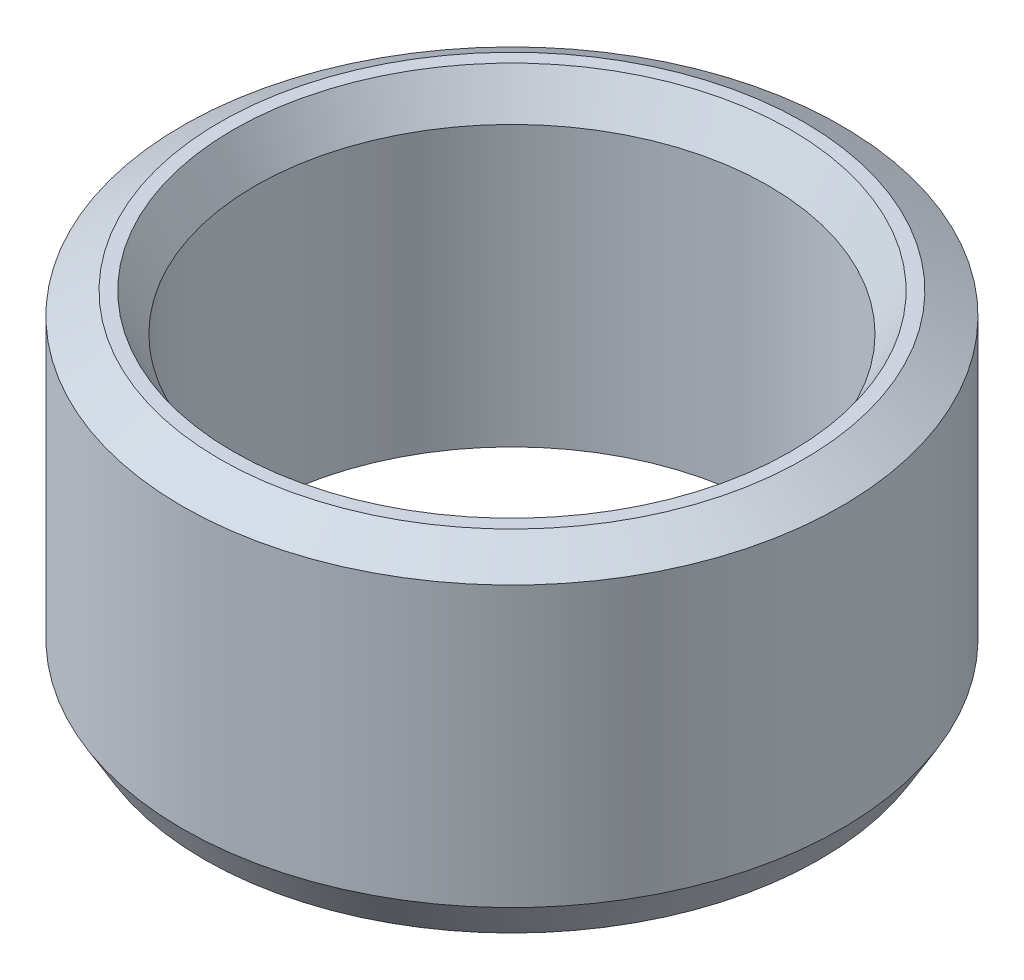
ISO-10303-21;
HEADER;
FILE_DESCRIPTION(('STEP AP214'),'2;1');
FILE_NAME('part.step','',(''),(''),'','','');
FILE_SCHEMA(('AUTOMOTIVE_DESIGN { 1 0 10303 214 1 1 1 1 }'));
ENDSEC;
DATA;
#1=APPLICATION_CONTEXT('core data for automotive mechanical design processes');
#2=APPLICATION_PROTOCOL_DEFINITION('international standard','automotive_design',2000,#1);
#3=PRODUCT_CONTEXT('',#1,'mechanical');
#4=PRODUCT('Part','Part','',(#3));
#5=PRODUCT_RELATED_PRODUCT_CATEGORY('part','',(#4));
#6=PRODUCT_DEFINITION_FORMATION('','',#4);
#7=PRODUCT_DEFINITION_CONTEXT('part definition',#1,'design');
#8=PRODUCT_DEFINITION('design','',#6,#7);
#9=PRODUCT_DEFINITION_SHAPE('','',#8);
#10=(LENGTH_UNIT() NAMED_UNIT(*) SI_UNIT(.MILLI.,.METRE.));
#11=(NAMED_UNIT(*) PLANE_ANGLE_UNIT() SI_UNIT($,.RADIAN.));
#12=(NAMED_UNIT(*) SI_UNIT($,.STERADIAN.) SOLID_ANGLE_UNIT());
#13=UNCERTAINTY_MEASURE_WITH_UNIT(LENGTH_MEASURE(1.E-05),#10,'distance_accuracy_value','');
#14=(GEOMETRIC_REPRESENTATION_CONTEXT(3) GLOBAL_UNCERTAINTY_ASSIGNED_CONTEXT((#13)) GLOBAL_UNIT_ASSIGNED_CONTEXT((#10,
#11,#12)) REPRESENTATION_CONTEXT('',''));
#15=CARTESIAN_POINT('',(0.,0.,0.));
#16=DIRECTION('',(0.,0.,1.));
#17=DIRECTION('',(1.,0.,0.));
#18=AXIS2_PLACEMENT_3D('',#15,#16,#17);
#19=CARTESIAN_POINT('',(0.,56.5471344407308,0.));
#20=DIRECTION('',(0.,-1.,0.));
#21=DIRECTION('',(0.,0.,-1.));
#22=AXIS2_PLACEMENT_3D('',#19,#20,#21);
#23=CYLINDRICAL_SURFACE('',#22,55.);
#24=CARTESIAN_POINT('',(0.,6.27071372216204,0.));
#25=DIRECTION('',(0.,1.,0.));
#26=DIRECTION('',(0.,0.,1.));
#27=AXIS2_PLACEMENT_3D('',#24,#25,#26);
#28=CIRCLE('',#27,55.);
#29=CARTESIAN_POINT('',(0.,6.27071372216204,55.));
#30=VERTEX_POINT('',#29);
#31=EDGE_CURVE('E10',#30,#30,#28,.T.);
#32=ORIENTED_EDGE('',*,*,#31,.T.);
#33=EDGE_LOOP('',(#32));
#34=FACE_BOUND('',#33,.T.);
#35=CARTESIAN_POINT('',(0.,52.8802172295628,0.));
#36=DIRECTION('',(0.,1.,0.));
#37=DIRECTION('',(0.,0.,1.));
#38=AXIS2_PLACEMENT_3D('',#35,#36,#37);
#39=CIRCLE('',#38,55.);
#40=CARTESIAN_POINT('',(0.,52.8802172295628,55.));
#41=VERTEX_POINT('',#40);
#42=EDGE_CURVE('E50',#41,#41,#39,.F.);
#43=ORIENTED_EDGE('',*,*,#42,.T.);
#44=EDGE_LOOP('',(#43));
#45=FACE_BOUND('',#44,.T.);
#46=ADVANCED_FACE('F39',(#34,#45),#23,.T.);
#47=CARTESIAN_POINT('',(0.,56.5471344407308,0.));
#48=DIRECTION('',(0.,1.,0.));
#49=DIRECTION('',(0.,0.,1.));
#50=AXIS2_PLACEMENT_3D('',#47,#48,#49);
#51=PLANE('',#50);
#52=CARTESIAN_POINT('',(0.,56.5471344407308,0.));
#53=DIRECTION('',(0.,1.,0.));
#54=DIRECTION('',(0.,0.,1.));
#55=AXIS2_PLACEMENT_3D('',#52,#53,#54);
#56=CIRCLE('',#55,46.516182477283);
#57=CARTESIAN_POINT('',(0.,56.5471344407308,46.516182477283));
#58=VERTEX_POINT('',#57);
#59=EDGE_CURVE('E58',#58,#58,#56,.F.);
#60=ORIENTED_EDGE('',*,*,#59,.T.);
#61=EDGE_LOOP('',(#60));
#62=FACE_BOUND('',#61,.T.);
#63=CARTESIAN_POINT('',(0.,56.5471344407308,0.));
#64=DIRECTION('',(0.,1.,0.));
#65=DIRECTION('',(0.,0.,1.));
#66=AXIS2_PLACEMENT_3D('',#63,#64,#65);
#67=CIRCLE('',#66,48.7292862778379);
#68=CARTESIAN_POINT('',(0.,56.5471344407308,48.7292862778379));
#69=VERTEX_POINT('',#68);
#70=EDGE_CURVE('E61',#69,#69,#67,.T.);
#71=ORIENTED_EDGE('',*,*,#70,.T.);
#72=EDGE_LOOP('',(#71));
#73=FACE_BOUND('',#72,.T.);
#74=ADVANCED_FACE('F88',(#62,#73),#51,.T.);
#75=CARTESIAN_POINT('',(0.,0.,0.));
#76=DIRECTION('',(0.,1.,0.));
#77=DIRECTION('',(0.,0.,1.));
#78=AXIS2_PLACEMENT_3D('',#75,#76,#77);
#79=PLANE('',#78);
#80=CARTESIAN_POINT('',(0.,0.,0.));
#81=DIRECTION('',(0.,1.,0.));
#82=DIRECTION('',(0.,0.,1.));
#83=AXIS2_PLACEMENT_3D('',#80,#81,#82);
#84=CIRCLE('',#83,49.1199789882771);
#85=CARTESIAN_POINT('',(0.,0.,49.1199789882771));
#86=VERTEX_POINT('',#85);
#87=EDGE_CURVE('E51',#86,#86,#84,.T.);
#88=ORIENTED_EDGE('',*,*,#87,.T.);
#89=EDGE_LOOP('',(#88));
#90=FACE_BOUND('',#89,.T.);
#91=CARTESIAN_POINT('',(0.,0.,0.));
#92=DIRECTION('',(0.,1.,0.));
#93=DIRECTION('',(0.,0.,1.));
#94=AXIS2_PLACEMENT_3D('',#91,#92,#93);
#95=CIRCLE('',#94,51.3330827888321);
#96=CARTESIAN_POINT('',(0.,0.,51.3330827888321));
#97=VERTEX_POINT('',#96);
#98=EDGE_CURVE('E54',#97,#97,#95,.F.);
#99=ORIENTED_EDGE('',*,*,#98,.T.);
#100=EDGE_LOOP('',(#99));
#101=FACE_BOUND('',#100,.T.);
#102=ADVANCED_FACE('F83',(#90,#101),#79,.F.);
#103=CARTESIAN_POINT('',(0.,56.5471344407308,0.));
#104=DIRECTION('',(0.,-1.,0.));
#105=DIRECTION('',(0.,0.,-1.));
#106=AXIS2_PLACEMENT_3D('',#103,#104,#105);
#107=CYLINDRICAL_SURFACE('',#106,42.849265266115);
#108=CARTESIAN_POINT('',(0.,50.2764207185687,0.));
#109=DIRECTION('',(0.,1.,0.));
#110=DIRECTION('',(0.,0.,1.));
#111=AXIS2_PLACEMENT_3D('',#108,#109,#110);
#112=CIRCLE('',#111,42.849265266115);
#113=CARTESIAN_POINT('',(0.,50.2764207185687,42.849265266115));
#114=VERTEX_POINT('',#113);
#115=EDGE_CURVE('E67',#114,#114,#112,.T.);
#116=ORIENTED_EDGE('',*,*,#115,.T.);
#117=EDGE_LOOP('',(#116));
#118=FACE_BOUND('',#117,.T.);
#119=CARTESIAN_POINT('',(0.,3.66691721116794,0.));
#120=DIRECTION('',(0.,1.,0.));
#121=DIRECTION('',(0.,0.,1.));
#122=AXIS2_PLACEMENT_3D('',#119,#120,#121);
#123=CIRCLE('',#122,42.849265266115);
#124=CARTESIAN_POINT('',(0.,3.66691721116794,42.849265266115));
#125=VERTEX_POINT('',#124);
#126=EDGE_CURVE('E69',#125,#125,#123,.F.);
#127=ORIENTED_EDGE('',*,*,#126,.T.);
#128=EDGE_LOOP('',(#127));
#129=FACE_BOUND('',#128,.T.);
#130=ADVANCED_FACE('F71',(#118,#129),#107,.F.);
#131=CARTESIAN_POINT('',(0.,50.2764207185687,0.));
#132=DIRECTION('',(0.,1.,0.));
#133=DIRECTION('',(0.,0.,1.));
#134=AXIS2_PLACEMENT_3D('',#131,#132,#133);
#135=CONICAL_SURFACE('',#134,42.849265266115,0.529144738402658);
#136=ORIENTED_EDGE('',*,*,#59,.F.);
#137=EDGE_LOOP('',(#136));
#138=FACE_BOUND('',#137,.T.);
#139=ORIENTED_EDGE('',*,*,#115,.F.);
#140=EDGE_LOOP('',(#139));
#141=FACE_BOUND('',#140,.T.);
#142=ADVANCED_FACE('F77',(#138,#141),#135,.F.);
#143=CARTESIAN_POINT('',(0.,0.,0.));
#144=DIRECTION('',(0.,-1.,0.));
#145=DIRECTION('',(0.,0.,-1.));
#146=AXIS2_PLACEMENT_3D('',#143,#144,#145);
#147=CONICAL_SURFACE('',#146,49.1199789882771,1.04165158839224);
#148=ORIENTED_EDGE('',*,*,#126,.F.);
#149=EDGE_LOOP('',(#148));
#150=FACE_BOUND('',#149,.T.);
#151=ORIENTED_EDGE('',*,*,#87,.F.);
#152=EDGE_LOOP('',(#151));
#153=FACE_BOUND('',#152,.T.);
#154=ADVANCED_FACE('F73',(#150,#153),#147,.F.);
#155=CARTESIAN_POINT('',(0.,6.27071372216204,0.));
#156=DIRECTION('',(0.,1.,0.));
#157=DIRECTION('',(0.,0.,1.));
#158=AXIS2_PLACEMENT_3D('',#155,#156,#157);
#159=CONICAL_SURFACE('',#158,55.,0.529144738402658);
#160=ORIENTED_EDGE('',*,*,#98,.F.);
#161=EDGE_LOOP('',(#160));
#162=FACE_BOUND('',#161,.T.);
#163=ORIENTED_EDGE('',*,*,#31,.F.);
#164=EDGE_LOOP('',(#163));
#165=FACE_BOUND('',#164,.T.);
#166=ADVANCED_FACE('F76',(#162,#165),#159,.T.);
#167=CARTESIAN_POINT('',(0.,56.5471344407308,0.));
#168=DIRECTION('',(0.,-1.,0.));
#169=DIRECTION('',(0.,0.,-1.));
#170=AXIS2_PLACEMENT_3D('',#167,#168,#169);
#171=CONICAL_SURFACE('',#170,48.7292862778379,1.04165158839224);
#172=ORIENTED_EDGE('',*,*,#42,.F.);
#173=EDGE_LOOP('',(#172));
#174=FACE_BOUND('',#173,.T.);
#175=ORIENTED_EDGE('',*,*,#70,.F.);
#176=EDGE_LOOP('',(#175));
#177=FACE_BOUND('',#176,.T.);
#178=ADVANCED_FACE('F45',(#174,#177),#171,.T.);
#179=CLOSED_SHELL('',(#46,#74,#102,#130,#142,#154,#166,#178));
#180=MANIFOLD_SOLID_BREP('B2',#179);
#181=ADVANCED_BREP_SHAPE_REPRESENTATION('',(#18,#180),#14);
#182=SHAPE_DEFINITION_REPRESENTATION(#9,#181);
ENDSEC;
END-ISO-10303-21;
